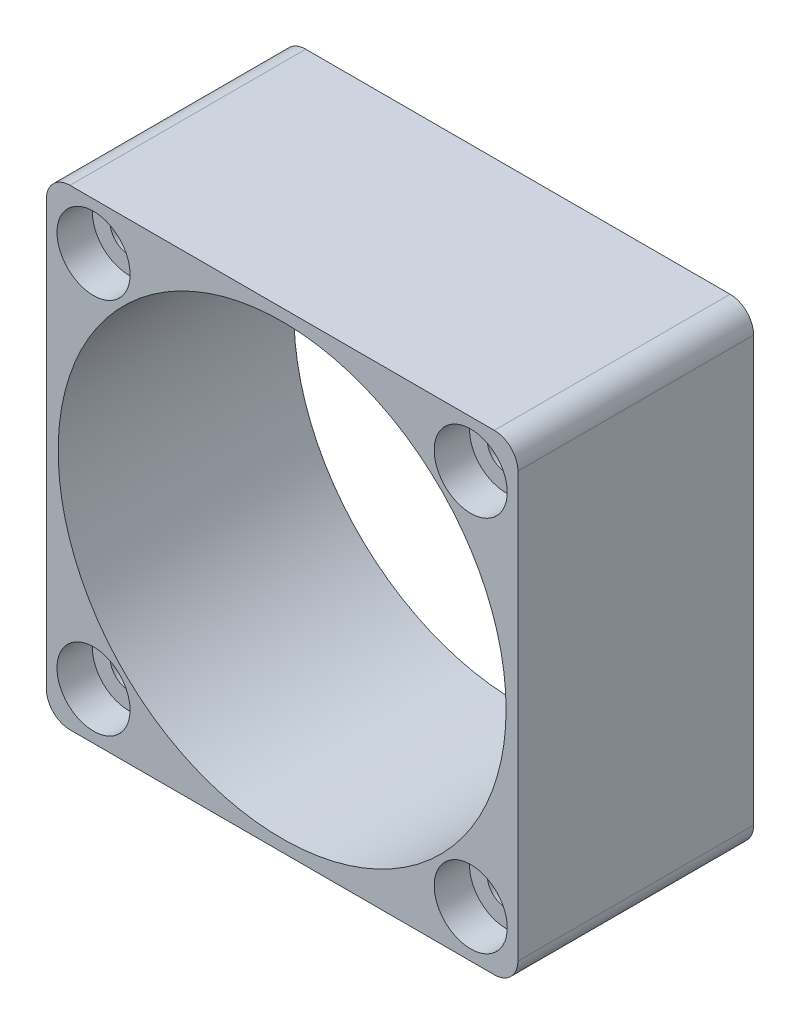
ISO-10303-21;
HEADER;
FILE_DESCRIPTION(('STEP AP214'),'2;1');
FILE_NAME('part.step','',(''),(''),'','','');
FILE_SCHEMA(('AUTOMOTIVE_DESIGN { 1 0 10303 214 1 1 1 1 }'));
ENDSEC;
DATA;
#1=APPLICATION_CONTEXT('core data for automotive mechanical design processes');
#2=APPLICATION_PROTOCOL_DEFINITION('international standard','automotive_design',2000,#1);
#3=PRODUCT_CONTEXT('',#1,'mechanical');
#4=PRODUCT('Part','Part','',(#3));
#5=PRODUCT_RELATED_PRODUCT_CATEGORY('part','',(#4));
#6=PRODUCT_DEFINITION_FORMATION('','',#4);
#7=PRODUCT_DEFINITION_CONTEXT('part definition',#1,'design');
#8=PRODUCT_DEFINITION('design','',#6,#7);
#9=PRODUCT_DEFINITION_SHAPE('','',#8);
#10=(LENGTH_UNIT() NAMED_UNIT(*) SI_UNIT(.MILLI.,.METRE.));
#11=(NAMED_UNIT(*) PLANE_ANGLE_UNIT() SI_UNIT($,.RADIAN.));
#12=(NAMED_UNIT(*) SI_UNIT($,.STERADIAN.) SOLID_ANGLE_UNIT());
#13=UNCERTAINTY_MEASURE_WITH_UNIT(LENGTH_MEASURE(1.E-05),#10,'distance_accuracy_value','');
#14=(GEOMETRIC_REPRESENTATION_CONTEXT(3) GLOBAL_UNCERTAINTY_ASSIGNED_CONTEXT((#13)) GLOBAL_UNIT_ASSIGNED_CONTEXT((#10,
#11,#12)) REPRESENTATION_CONTEXT('',''));
#15=CARTESIAN_POINT('',(0.,0.,0.));
#16=DIRECTION('',(0.,0.,1.));
#17=DIRECTION('',(1.,0.,0.));
#18=AXIS2_PLACEMENT_3D('',#15,#16,#17);
#19=CARTESIAN_POINT('',(-16.,16.,0.));
#20=DIRECTION('',(0.,0.,1.));
#21=DIRECTION('',(1.,0.,0.));
#22=AXIS2_PLACEMENT_3D('',#19,#20,#21);
#23=CYLINDRICAL_SURFACE('',#22,1.6);
#24=CARTESIAN_POINT('',(-16.,16.,0.));
#25=DIRECTION('',(0.,0.,1.));
#26=DIRECTION('',(1.,0.,0.));
#27=AXIS2_PLACEMENT_3D('',#24,#25,#26);
#28=CIRCLE('',#27,1.6);
#29=CARTESIAN_POINT('',(-14.4,16.,0.));
#30=VERTEX_POINT('',#29);
#31=EDGE_CURVE('E200',#30,#30,#28,.T.);
#32=ORIENTED_EDGE('',*,*,#31,.F.);
#33=EDGE_LOOP('',(#32));
#34=FACE_BOUND('',#33,.T.);
#35=CARTESIAN_POINT('',(-16.,16.,17.));
#36=DIRECTION('',(0.,0.,1.));
#37=DIRECTION('',(1.,0.,0.));
#38=AXIS2_PLACEMENT_3D('',#35,#36,#37);
#39=CIRCLE('',#38,1.6);
#40=CARTESIAN_POINT('',(-14.4,16.,17.));
#41=VERTEX_POINT('',#40);
#42=EDGE_CURVE('E38',#41,#41,#39,.F.);
#43=ORIENTED_EDGE('',*,*,#42,.F.);
#44=EDGE_LOOP('',(#43));
#45=FACE_BOUND('',#44,.T.);
#46=ADVANCED_FACE('F34',(#34,#45),#23,.F.);
#47=CARTESIAN_POINT('',(16.,16.,0.));
#48=DIRECTION('',(0.,0.,1.));
#49=DIRECTION('',(1.,0.,0.));
#50=AXIS2_PLACEMENT_3D('',#47,#48,#49);
#51=CYLINDRICAL_SURFACE('',#50,1.6);
#52=CARTESIAN_POINT('',(16.,16.,0.));
#53=DIRECTION('',(0.,0.,1.));
#54=DIRECTION('',(1.,0.,0.));
#55=AXIS2_PLACEMENT_3D('',#52,#53,#54);
#56=CIRCLE('',#55,1.6);
#57=CARTESIAN_POINT('',(17.6,16.,0.));
#58=VERTEX_POINT('',#57);
#59=EDGE_CURVE('E197',#58,#58,#56,.T.);
#60=ORIENTED_EDGE('',*,*,#59,.F.);
#61=EDGE_LOOP('',(#60));
#62=FACE_BOUND('',#61,.T.);
#63=CARTESIAN_POINT('',(16.,16.,17.));
#64=DIRECTION('',(0.,0.,1.));
#65=DIRECTION('',(1.,0.,0.));
#66=AXIS2_PLACEMENT_3D('',#63,#64,#65);
#67=CIRCLE('',#66,1.6);
#68=CARTESIAN_POINT('',(17.6,16.,17.));
#69=VERTEX_POINT('',#68);
#70=EDGE_CURVE('E167',#69,#69,#67,.F.);
#71=ORIENTED_EDGE('',*,*,#70,.F.);
#72=EDGE_LOOP('',(#71));
#73=FACE_BOUND('',#72,.T.);
#74=ADVANCED_FACE('F237',(#62,#73),#51,.F.);
#75=CARTESIAN_POINT('',(16.,-16.,0.));
#76=DIRECTION('',(0.,0.,1.));
#77=DIRECTION('',(1.,0.,0.));
#78=AXIS2_PLACEMENT_3D('',#75,#76,#77);
#79=CYLINDRICAL_SURFACE('',#78,1.6);
#80=CARTESIAN_POINT('',(16.,-16.,0.));
#81=DIRECTION('',(0.,0.,1.));
#82=DIRECTION('',(1.,0.,0.));
#83=AXIS2_PLACEMENT_3D('',#80,#81,#82);
#84=CIRCLE('',#83,1.6);
#85=CARTESIAN_POINT('',(17.6,-16.,0.));
#86=VERTEX_POINT('',#85);
#87=EDGE_CURVE('E194',#86,#86,#84,.T.);
#88=ORIENTED_EDGE('',*,*,#87,.F.);
#89=EDGE_LOOP('',(#88));
#90=FACE_BOUND('',#89,.T.);
#91=CARTESIAN_POINT('',(16.,-16.,17.));
#92=DIRECTION('',(0.,0.,1.));
#93=DIRECTION('',(1.,0.,0.));
#94=AXIS2_PLACEMENT_3D('',#91,#92,#93);
#95=CIRCLE('',#94,1.6);
#96=CARTESIAN_POINT('',(17.6,-16.,17.));
#97=VERTEX_POINT('',#96);
#98=EDGE_CURVE('E163',#97,#97,#95,.F.);
#99=ORIENTED_EDGE('',*,*,#98,.F.);
#100=EDGE_LOOP('',(#99));
#101=FACE_BOUND('',#100,.T.);
#102=ADVANCED_FACE('F243',(#90,#101),#79,.F.);
#103=CARTESIAN_POINT('',(-16.,-16.,0.));
#104=DIRECTION('',(0.,0.,1.));
#105=DIRECTION('',(1.,0.,0.));
#106=AXIS2_PLACEMENT_3D('',#103,#104,#105);
#107=CYLINDRICAL_SURFACE('',#106,1.6);
#108=CARTESIAN_POINT('',(-16.,-16.,0.));
#109=DIRECTION('',(0.,0.,1.));
#110=DIRECTION('',(1.,0.,0.));
#111=AXIS2_PLACEMENT_3D('',#108,#109,#110);
#112=CIRCLE('',#111,1.6);
#113=CARTESIAN_POINT('',(-14.4,-16.,0.));
#114=VERTEX_POINT('',#113);
#115=EDGE_CURVE('E161',#114,#114,#112,.T.);
#116=ORIENTED_EDGE('',*,*,#115,.F.);
#117=EDGE_LOOP('',(#116));
#118=FACE_BOUND('',#117,.T.);
#119=CARTESIAN_POINT('',(-16.,-16.,17.));
#120=DIRECTION('',(0.,0.,1.));
#121=DIRECTION('',(1.,0.,0.));
#122=AXIS2_PLACEMENT_3D('',#119,#120,#121);
#123=CIRCLE('',#122,1.6);
#124=CARTESIAN_POINT('',(-14.4,-16.,17.));
#125=VERTEX_POINT('',#124);
#126=EDGE_CURVE('E158',#125,#125,#123,.F.);
#127=ORIENTED_EDGE('',*,*,#126,.F.);
#128=EDGE_LOOP('',(#127));
#129=FACE_BOUND('',#128,.T.);
#130=ADVANCED_FACE('F276',(#118,#129),#107,.F.);
#131=CARTESIAN_POINT('',(20.,20.,20.));
#132=DIRECTION('',(-1.,0.,0.));
#133=DIRECTION('',(0.,0.,1.));
#134=AXIS2_PLACEMENT_3D('',#131,#132,#133);
#135=PLANE('',#134);
#136=DIRECTION('',(0.,1.,0.));
#137=VECTOR('',#136,1.);
#138=CARTESIAN_POINT('',(20.,20.,20.));
#139=LINE('',#138,#137);
#140=CARTESIAN_POINT('',(20.,-18.,20.));
#141=VERTEX_POINT('',#140);
#142=CARTESIAN_POINT('',(20.,18.,20.));
#143=VERTEX_POINT('',#142);
#144=EDGE_CURVE('E130',#141,#143,#139,.T.);
#145=ORIENTED_EDGE('',*,*,#144,.F.);
#146=DIRECTION('',(0.,0.,-1.));
#147=VECTOR('',#146,1.);
#148=CARTESIAN_POINT('',(20.,-18.,20.));
#149=LINE('',#148,#147);
#150=CARTESIAN_POINT('',(20.,-18.,0.));
#151=VERTEX_POINT('',#150);
#152=EDGE_CURVE('E11',#141,#151,#149,.T.);
#153=ORIENTED_EDGE('',*,*,#152,.T.);
#154=DIRECTION('',(0.,1.,0.));
#155=VECTOR('',#154,1.);
#156=CARTESIAN_POINT('',(20.,20.,0.));
#157=LINE('',#156,#155);
#158=CARTESIAN_POINT('',(20.,18.,0.));
#159=VERTEX_POINT('',#158);
#160=EDGE_CURVE('E207',#151,#159,#157,.T.);
#161=ORIENTED_EDGE('',*,*,#160,.T.);
#162=DIRECTION('',(0.,0.,-1.));
#163=VECTOR('',#162,1.);
#164=CARTESIAN_POINT('',(20.,18.,20.));
#165=LINE('',#164,#163);
#166=EDGE_CURVE('E43',#159,#143,#165,.F.);
#167=ORIENTED_EDGE('',*,*,#166,.T.);
#168=EDGE_LOOP('',(#145,#153,#161,#167));
#169=FACE_BOUND('',#168,.T.);
#170=ADVANCED_FACE('F234',(#169),#135,.F.);
#171=CARTESIAN_POINT('',(-20.,20.,20.));
#172=DIRECTION('',(0.,-1.,0.));
#173=DIRECTION('',(0.,0.,-1.));
#174=AXIS2_PLACEMENT_3D('',#171,#172,#173);
#175=PLANE('',#174);
#176=DIRECTION('',(-1.,0.,0.));
#177=VECTOR('',#176,1.);
#178=CARTESIAN_POINT('',(-20.,20.,0.));
#179=LINE('',#178,#177);
#180=CARTESIAN_POINT('',(18.,20.,0.));
#181=VERTEX_POINT('',#180);
#182=CARTESIAN_POINT('',(-18.,20.,0.));
#183=VERTEX_POINT('',#182);
#184=EDGE_CURVE('E135',#181,#183,#179,.T.);
#185=ORIENTED_EDGE('',*,*,#184,.T.);
#186=DIRECTION('',(0.,0.,-1.));
#187=VECTOR('',#186,1.);
#188=CARTESIAN_POINT('',(-18.,20.,20.));
#189=LINE('',#188,#187);
#190=CARTESIAN_POINT('',(-18.,20.,20.));
#191=VERTEX_POINT('',#190);
#192=EDGE_CURVE('E51',#183,#191,#189,.F.);
#193=ORIENTED_EDGE('',*,*,#192,.T.);
#194=DIRECTION('',(-1.,0.,0.));
#195=VECTOR('',#194,1.);
#196=CARTESIAN_POINT('',(-20.,20.,20.));
#197=LINE('',#196,#195);
#198=CARTESIAN_POINT('',(18.,20.,20.));
#199=VERTEX_POINT('',#198);
#200=EDGE_CURVE('E133',#199,#191,#197,.T.);
#201=ORIENTED_EDGE('',*,*,#200,.F.);
#202=DIRECTION('',(0.,0.,-1.));
#203=VECTOR('',#202,1.);
#204=CARTESIAN_POINT('',(18.,20.,20.));
#205=LINE('',#204,#203);
#206=EDGE_CURVE('E153',#199,#181,#205,.T.);
#207=ORIENTED_EDGE('',*,*,#206,.T.);
#208=EDGE_LOOP('',(#185,#193,#201,#207));
#209=FACE_BOUND('',#208,.T.);
#210=ADVANCED_FACE('F217',(#209),#175,.F.);
#211=CARTESIAN_POINT('',(-20.,20.,20.));
#212=DIRECTION('',(1.,0.,0.));
#213=DIRECTION('',(0.,1.,0.));
#214=AXIS2_PLACEMENT_3D('',#211,#212,#213);
#215=PLANE('',#214);
#216=DIRECTION('',(0.,-1.,0.));
#217=VECTOR('',#216,1.);
#218=CARTESIAN_POINT('',(-20.,20.,0.));
#219=LINE('',#218,#217);
#220=CARTESIAN_POINT('',(-20.,18.,0.));
#221=VERTEX_POINT('',#220);
#222=CARTESIAN_POINT('',(-20.,-18.,0.));
#223=VERTEX_POINT('',#222);
#224=EDGE_CURVE('E131',#221,#223,#219,.T.);
#225=ORIENTED_EDGE('',*,*,#224,.T.);
#226=DIRECTION('',(0.,0.,-1.));
#227=VECTOR('',#226,1.);
#228=CARTESIAN_POINT('',(-20.,-18.,20.));
#229=LINE('',#228,#227);
#230=CARTESIAN_POINT('',(-20.,-18.,20.));
#231=VERTEX_POINT('',#230);
#232=EDGE_CURVE('E108',#223,#231,#229,.F.);
#233=ORIENTED_EDGE('',*,*,#232,.T.);
#234=DIRECTION('',(0.,-1.,0.));
#235=VECTOR('',#234,1.);
#236=CARTESIAN_POINT('',(-20.,20.,20.));
#237=LINE('',#236,#235);
#238=CARTESIAN_POINT('',(-20.,18.,20.));
#239=VERTEX_POINT('',#238);
#240=EDGE_CURVE('E211',#239,#231,#237,.T.);
#241=ORIENTED_EDGE('',*,*,#240,.F.);
#242=DIRECTION('',(0.,0.,-1.));
#243=VECTOR('',#242,1.);
#244=CARTESIAN_POINT('',(-20.,18.,20.));
#245=LINE('',#244,#243);
#246=EDGE_CURVE('E113',#239,#221,#245,.T.);
#247=ORIENTED_EDGE('',*,*,#246,.T.);
#248=EDGE_LOOP('',(#225,#233,#241,#247));
#249=FACE_BOUND('',#248,.T.);
#250=ADVANCED_FACE('F226',(#249),#215,.F.);
#251=CARTESIAN_POINT('',(-20.,-20.,20.));
#252=DIRECTION('',(0.,1.,0.));
#253=DIRECTION('',(0.,0.,1.));
#254=AXIS2_PLACEMENT_3D('',#251,#252,#253);
#255=PLANE('',#254);
#256=DIRECTION('',(1.,0.,0.));
#257=VECTOR('',#256,1.);
#258=CARTESIAN_POINT('',(-20.,-20.,20.));
#259=LINE('',#258,#257);
#260=CARTESIAN_POINT('',(-18.,-20.,20.));
#261=VERTEX_POINT('',#260);
#262=CARTESIAN_POINT('',(18.,-20.,20.));
#263=VERTEX_POINT('',#262);
#264=EDGE_CURVE('E123',#261,#263,#259,.T.);
#265=ORIENTED_EDGE('',*,*,#264,.F.);
#266=DIRECTION('',(0.,0.,-1.));
#267=VECTOR('',#266,1.);
#268=CARTESIAN_POINT('',(-18.,-20.,20.));
#269=LINE('',#268,#267);
#270=CARTESIAN_POINT('',(-18.,-20.,0.));
#271=VERTEX_POINT('',#270);
#272=EDGE_CURVE('E107',#261,#271,#269,.T.);
#273=ORIENTED_EDGE('',*,*,#272,.T.);
#274=DIRECTION('',(1.,0.,0.));
#275=VECTOR('',#274,1.);
#276=CARTESIAN_POINT('',(-20.,-20.,0.));
#277=LINE('',#276,#275);
#278=CARTESIAN_POINT('',(18.,-20.,0.));
#279=VERTEX_POINT('',#278);
#280=EDGE_CURVE('E120',#271,#279,#277,.T.);
#281=ORIENTED_EDGE('',*,*,#280,.T.);
#282=DIRECTION('',(0.,0.,-1.));
#283=VECTOR('',#282,1.);
#284=CARTESIAN_POINT('',(18.,-20.,20.));
#285=LINE('',#284,#283);
#286=EDGE_CURVE('E125',#279,#263,#285,.F.);
#287=ORIENTED_EDGE('',*,*,#286,.T.);
#288=EDGE_LOOP('',(#265,#273,#281,#287));
#289=FACE_BOUND('',#288,.T.);
#290=ADVANCED_FACE('F119',(#289),#255,.F.);
#291=CARTESIAN_POINT('',(0.,0.,20.));
#292=DIRECTION('',(0.,0.,1.));
#293=DIRECTION('',(1.,0.,0.));
#294=AXIS2_PLACEMENT_3D('',#291,#292,#293);
#295=PLANE('',#294);
#296=CARTESIAN_POINT('',(-16.,16.,20.));
#297=DIRECTION('',(0.,0.,1.));
#298=DIRECTION('',(1.,0.,0.));
#299=AXIS2_PLACEMENT_3D('',#296,#297,#298);
#300=CIRCLE('',#299,3.1);
#301=CARTESIAN_POINT('',(-12.9,16.,20.));
#302=VERTEX_POINT('',#301);
#303=EDGE_CURVE('E183',#302,#302,#300,.T.);
#304=ORIENTED_EDGE('',*,*,#303,.F.);
#305=EDGE_LOOP('',(#304));
#306=FACE_BOUND('',#305,.T.);
#307=CARTESIAN_POINT('',(16.,16.,20.));
#308=DIRECTION('',(0.,0.,1.));
#309=DIRECTION('',(1.,0.,0.));
#310=AXIS2_PLACEMENT_3D('',#307,#308,#309);
#311=CIRCLE('',#310,3.1);
#312=CARTESIAN_POINT('',(19.1,16.,20.));
#313=VERTEX_POINT('',#312);
#314=EDGE_CURVE('E176',#313,#313,#311,.T.);
#315=ORIENTED_EDGE('',*,*,#314,.F.);
#316=EDGE_LOOP('',(#315));
#317=FACE_BOUND('',#316,.T.);
#318=CARTESIAN_POINT('',(16.,-16.,20.));
#319=DIRECTION('',(0.,0.,1.));
#320=DIRECTION('',(1.,0.,0.));
#321=AXIS2_PLACEMENT_3D('',#318,#319,#320);
#322=CIRCLE('',#321,3.1);
#323=CARTESIAN_POINT('',(19.1,-16.,20.));
#324=VERTEX_POINT('',#323);
#325=EDGE_CURVE('E169',#324,#324,#322,.T.);
#326=ORIENTED_EDGE('',*,*,#325,.F.);
#327=EDGE_LOOP('',(#326));
#328=FACE_BOUND('',#327,.T.);
#329=CARTESIAN_POINT('',(-16.,-16.,20.));
#330=DIRECTION('',(0.,0.,1.));
#331=DIRECTION('',(1.,0.,0.));
#332=AXIS2_PLACEMENT_3D('',#329,#330,#331);
#333=CIRCLE('',#332,3.1);
#334=CARTESIAN_POINT('',(-12.9,-16.,20.));
#335=VERTEX_POINT('',#334);
#336=EDGE_CURVE('E165',#335,#335,#333,.T.);
#337=ORIENTED_EDGE('',*,*,#336,.F.);
#338=EDGE_LOOP('',(#337));
#339=FACE_BOUND('',#338,.T.);
#340=CARTESIAN_POINT('',(0.,0.,20.));
#341=DIRECTION('',(0.,0.,1.));
#342=DIRECTION('',(1.,0.,0.));
#343=AXIS2_PLACEMENT_3D('',#340,#341,#342);
#344=CIRCLE('',#343,19.);
#345=CARTESIAN_POINT('',(19.,0.,20.));
#346=VERTEX_POINT('',#345);
#347=EDGE_CURVE('E203',#346,#346,#344,.T.);
#348=ORIENTED_EDGE('',*,*,#347,.F.);
#349=EDGE_LOOP('',(#348));
#350=FACE_BOUND('',#349,.T.);
#351=ORIENTED_EDGE('',*,*,#240,.T.);
#352=CARTESIAN_POINT('',(-18.,-18.,20.));
#353=DIRECTION('',(0.,0.,1.));
#354=DIRECTION('',(1.,0.,0.));
#355=AXIS2_PLACEMENT_3D('',#352,#353,#354);
#356=CIRCLE('',#355,2.);
#357=EDGE_CURVE('E151',#231,#261,#356,.T.);
#358=ORIENTED_EDGE('',*,*,#357,.T.);
#359=ORIENTED_EDGE('',*,*,#264,.T.);
#360=CARTESIAN_POINT('',(18.,-18.,20.));
#361=DIRECTION('',(0.,0.,1.));
#362=DIRECTION('',(1.,0.,0.));
#363=AXIS2_PLACEMENT_3D('',#360,#361,#362);
#364=CIRCLE('',#363,2.);
#365=EDGE_CURVE('E147',#263,#141,#364,.T.);
#366=ORIENTED_EDGE('',*,*,#365,.T.);
#367=ORIENTED_EDGE('',*,*,#144,.T.);
#368=CARTESIAN_POINT('',(18.,18.,20.));
#369=DIRECTION('',(0.,0.,1.));
#370=DIRECTION('',(1.,0.,0.));
#371=AXIS2_PLACEMENT_3D('',#368,#369,#370);
#372=CIRCLE('',#371,2.);
#373=EDGE_CURVE('E58',#143,#199,#372,.T.);
#374=ORIENTED_EDGE('',*,*,#373,.T.);
#375=ORIENTED_EDGE('',*,*,#200,.T.);
#376=CARTESIAN_POINT('',(-18.,18.,20.));
#377=DIRECTION('',(0.,0.,1.));
#378=DIRECTION('',(1.,0.,0.));
#379=AXIS2_PLACEMENT_3D('',#376,#377,#378);
#380=CIRCLE('',#379,2.);
#381=EDGE_CURVE('E149',#191,#239,#380,.T.);
#382=ORIENTED_EDGE('',*,*,#381,.T.);
#383=EDGE_LOOP('',(#351,#358,#359,#366,#367,#374,#375,#382));
#384=FACE_BOUND('',#383,.T.);
#385=ADVANCED_FACE('F224',(#306,#317,#328,#339,#350,#384),#295,.T.);
#386=CARTESIAN_POINT('',(0.,0.,0.));
#387=DIRECTION('',(0.,0.,1.));
#388=DIRECTION('',(1.,0.,0.));
#389=AXIS2_PLACEMENT_3D('',#386,#387,#388);
#390=PLANE('',#389);
#391=ORIENTED_EDGE('',*,*,#115,.T.);
#392=EDGE_LOOP('',(#391));
#393=FACE_BOUND('',#392,.T.);
#394=ORIENTED_EDGE('',*,*,#87,.T.);
#395=EDGE_LOOP('',(#394));
#396=FACE_BOUND('',#395,.T.);
#397=ORIENTED_EDGE('',*,*,#59,.T.);
#398=EDGE_LOOP('',(#397));
#399=FACE_BOUND('',#398,.T.);
#400=ORIENTED_EDGE('',*,*,#31,.T.);
#401=EDGE_LOOP('',(#400));
#402=FACE_BOUND('',#401,.T.);
#403=CARTESIAN_POINT('',(0.,0.,0.));
#404=DIRECTION('',(0.,0.,1.));
#405=DIRECTION('',(1.,0.,0.));
#406=AXIS2_PLACEMENT_3D('',#403,#404,#405);
#407=CIRCLE('',#406,19.);
#408=CARTESIAN_POINT('',(19.,0.,0.));
#409=VERTEX_POINT('',#408);
#410=EDGE_CURVE('E204',#409,#409,#407,.T.);
#411=ORIENTED_EDGE('',*,*,#410,.T.);
#412=EDGE_LOOP('',(#411));
#413=FACE_BOUND('',#412,.T.);
#414=ORIENTED_EDGE('',*,*,#280,.F.);
#415=CARTESIAN_POINT('',(-18.,-18.,0.));
#416=DIRECTION('',(0.,0.,1.));
#417=DIRECTION('',(1.,0.,0.));
#418=AXIS2_PLACEMENT_3D('',#415,#416,#417);
#419=CIRCLE('',#418,2.);
#420=EDGE_CURVE('E103',#271,#223,#419,.F.);
#421=ORIENTED_EDGE('',*,*,#420,.T.);
#422=ORIENTED_EDGE('',*,*,#224,.F.);
#423=CARTESIAN_POINT('',(-18.,18.,0.));
#424=DIRECTION('',(0.,0.,1.));
#425=DIRECTION('',(1.,0.,0.));
#426=AXIS2_PLACEMENT_3D('',#423,#424,#425);
#427=CIRCLE('',#426,2.);
#428=EDGE_CURVE('E114',#221,#183,#427,.F.);
#429=ORIENTED_EDGE('',*,*,#428,.T.);
#430=ORIENTED_EDGE('',*,*,#184,.F.);
#431=CARTESIAN_POINT('',(18.,18.,0.));
#432=DIRECTION('',(0.,0.,1.));
#433=DIRECTION('',(1.,0.,0.));
#434=AXIS2_PLACEMENT_3D('',#431,#432,#433);
#435=CIRCLE('',#434,2.);
#436=EDGE_CURVE('E124',#181,#159,#435,.F.);
#437=ORIENTED_EDGE('',*,*,#436,.T.);
#438=ORIENTED_EDGE('',*,*,#160,.F.);
#439=CARTESIAN_POINT('',(18.,-18.,0.));
#440=DIRECTION('',(0.,0.,1.));
#441=DIRECTION('',(1.,0.,0.));
#442=AXIS2_PLACEMENT_3D('',#439,#440,#441);
#443=CIRCLE('',#442,2.);
#444=EDGE_CURVE('E129',#151,#279,#443,.F.);
#445=ORIENTED_EDGE('',*,*,#444,.T.);
#446=EDGE_LOOP('',(#414,#421,#422,#429,#430,#437,#438,#445));
#447=FACE_BOUND('',#446,.T.);
#448=ADVANCED_FACE('F127',(#393,#396,#399,#402,#413,#447),#390,.F.);
#449=CARTESIAN_POINT('',(0.,0.,0.));
#450=DIRECTION('',(0.,0.,1.));
#451=DIRECTION('',(1.,0.,0.));
#452=AXIS2_PLACEMENT_3D('',#449,#450,#451);
#453=CYLINDRICAL_SURFACE('',#452,19.);
#454=ORIENTED_EDGE('',*,*,#410,.F.);
#455=EDGE_LOOP('',(#454));
#456=FACE_BOUND('',#455,.T.);
#457=ORIENTED_EDGE('',*,*,#347,.T.);
#458=EDGE_LOOP('',(#457));
#459=FACE_BOUND('',#458,.T.);
#460=ADVANCED_FACE('F250',(#456,#459),#453,.F.);
#461=CARTESIAN_POINT('',(-18.,-18.,20.));
#462=DIRECTION('',(0.,0.,-1.));
#463=DIRECTION('',(-1.,0.,0.));
#464=AXIS2_PLACEMENT_3D('',#461,#462,#463);
#465=CYLINDRICAL_SURFACE('',#464,2.);
#466=ORIENTED_EDGE('',*,*,#357,.F.);
#467=ORIENTED_EDGE('',*,*,#232,.F.);
#468=ORIENTED_EDGE('',*,*,#420,.F.);
#469=ORIENTED_EDGE('',*,*,#272,.F.);
#470=EDGE_LOOP('',(#466,#467,#468,#469));
#471=FACE_BOUND('',#470,.T.);
#472=ADVANCED_FACE('F106',(#471),#465,.T.);
#473=CARTESIAN_POINT('',(-18.,18.,20.));
#474=DIRECTION('',(0.,0.,-1.));
#475=DIRECTION('',(-1.,0.,0.));
#476=AXIS2_PLACEMENT_3D('',#473,#474,#475);
#477=CYLINDRICAL_SURFACE('',#476,2.);
#478=ORIENTED_EDGE('',*,*,#381,.F.);
#479=ORIENTED_EDGE('',*,*,#192,.F.);
#480=ORIENTED_EDGE('',*,*,#428,.F.);
#481=ORIENTED_EDGE('',*,*,#246,.F.);
#482=EDGE_LOOP('',(#478,#479,#480,#481));
#483=FACE_BOUND('',#482,.T.);
#484=ADVANCED_FACE('F221',(#483),#477,.T.);
#485=CARTESIAN_POINT('',(18.,-18.,20.));
#486=DIRECTION('',(0.,0.,-1.));
#487=DIRECTION('',(-1.,0.,0.));
#488=AXIS2_PLACEMENT_3D('',#485,#486,#487);
#489=CYLINDRICAL_SURFACE('',#488,2.);
#490=ORIENTED_EDGE('',*,*,#365,.F.);
#491=ORIENTED_EDGE('',*,*,#286,.F.);
#492=ORIENTED_EDGE('',*,*,#444,.F.);
#493=ORIENTED_EDGE('',*,*,#152,.F.);
#494=EDGE_LOOP('',(#490,#491,#492,#493));
#495=FACE_BOUND('',#494,.T.);
#496=ADVANCED_FACE('F319',(#495),#489,.T.);
#497=CARTESIAN_POINT('',(18.,18.,20.));
#498=DIRECTION('',(0.,0.,-1.));
#499=DIRECTION('',(-1.,0.,0.));
#500=AXIS2_PLACEMENT_3D('',#497,#498,#499);
#501=CYLINDRICAL_SURFACE('',#500,2.);
#502=ORIENTED_EDGE('',*,*,#373,.F.);
#503=ORIENTED_EDGE('',*,*,#166,.F.);
#504=ORIENTED_EDGE('',*,*,#436,.F.);
#505=ORIENTED_EDGE('',*,*,#206,.F.);
#506=EDGE_LOOP('',(#502,#503,#504,#505));
#507=FACE_BOUND('',#506,.T.);
#508=ADVANCED_FACE('F36',(#507),#501,.T.);
#509=CARTESIAN_POINT('',(-16.,-16.,17.));
#510=DIRECTION('',(0.,0.,1.));
#511=DIRECTION('',(1.,0.,0.));
#512=AXIS2_PLACEMENT_3D('',#509,#510,#511);
#513=PLANE('',#512);
#514=CARTESIAN_POINT('',(-16.,-16.,17.));
#515=DIRECTION('',(0.,0.,1.));
#516=DIRECTION('',(1.,0.,0.));
#517=AXIS2_PLACEMENT_3D('',#514,#515,#516);
#518=CIRCLE('',#517,3.1);
#519=CARTESIAN_POINT('',(-12.9,-16.,17.));
#520=VERTEX_POINT('',#519);
#521=EDGE_CURVE('E162',#520,#520,#518,.T.);
#522=ORIENTED_EDGE('',*,*,#521,.T.);
#523=EDGE_LOOP('',(#522));
#524=FACE_BOUND('',#523,.T.);
#525=ORIENTED_EDGE('',*,*,#126,.T.);
#526=EDGE_LOOP('',(#525));
#527=FACE_BOUND('',#526,.T.);
#528=ADVANCED_FACE('F292',(#524,#527),#513,.T.);
#529=CARTESIAN_POINT('',(-16.,-16.,17.));
#530=DIRECTION('',(0.,0.,1.));
#531=DIRECTION('',(1.,0.,0.));
#532=AXIS2_PLACEMENT_3D('',#529,#530,#531);
#533=CYLINDRICAL_SURFACE('',#532,3.1);
#534=ORIENTED_EDGE('',*,*,#521,.F.);
#535=EDGE_LOOP('',(#534));
#536=FACE_BOUND('',#535,.T.);
#537=ORIENTED_EDGE('',*,*,#336,.T.);
#538=EDGE_LOOP('',(#537));
#539=FACE_BOUND('',#538,.T.);
#540=ADVANCED_FACE('F282',(#536,#539),#533,.F.);
#541=CARTESIAN_POINT('',(16.,-16.,17.));
#542=DIRECTION('',(0.,0.,1.));
#543=DIRECTION('',(1.,0.,0.));
#544=AXIS2_PLACEMENT_3D('',#541,#542,#543);
#545=PLANE('',#544);
#546=CARTESIAN_POINT('',(16.,-16.,17.));
#547=DIRECTION('',(0.,0.,1.));
#548=DIRECTION('',(1.,0.,0.));
#549=AXIS2_PLACEMENT_3D('',#546,#547,#548);
#550=CIRCLE('',#549,3.1);
#551=CARTESIAN_POINT('',(19.1,-16.,17.));
#552=VERTEX_POINT('',#551);
#553=EDGE_CURVE('E166',#552,#552,#550,.T.);
#554=ORIENTED_EDGE('',*,*,#553,.T.);
#555=EDGE_LOOP('',(#554));
#556=FACE_BOUND('',#555,.T.);
#557=ORIENTED_EDGE('',*,*,#98,.T.);
#558=EDGE_LOOP('',(#557));
#559=FACE_BOUND('',#558,.T.);
#560=ADVANCED_FACE('F279',(#556,#559),#545,.T.);
#561=CARTESIAN_POINT('',(16.,-16.,17.));
#562=DIRECTION('',(0.,0.,1.));
#563=DIRECTION('',(1.,0.,0.));
#564=AXIS2_PLACEMENT_3D('',#561,#562,#563);
#565=CYLINDRICAL_SURFACE('',#564,3.1);
#566=ORIENTED_EDGE('',*,*,#553,.F.);
#567=EDGE_LOOP('',(#566));
#568=FACE_BOUND('',#567,.T.);
#569=ORIENTED_EDGE('',*,*,#325,.T.);
#570=EDGE_LOOP('',(#569));
#571=FACE_BOUND('',#570,.T.);
#572=ADVANCED_FACE('F281',(#568,#571),#565,.F.);
#573=CARTESIAN_POINT('',(16.,16.,17.));
#574=DIRECTION('',(0.,0.,1.));
#575=DIRECTION('',(1.,0.,0.));
#576=AXIS2_PLACEMENT_3D('',#573,#574,#575);
#577=PLANE('',#576);
#578=CARTESIAN_POINT('',(16.,16.,17.));
#579=DIRECTION('',(0.,0.,1.));
#580=DIRECTION('',(1.,0.,0.));
#581=AXIS2_PLACEMENT_3D('',#578,#579,#580);
#582=CIRCLE('',#581,3.1);
#583=CARTESIAN_POINT('',(19.1,16.,17.));
#584=VERTEX_POINT('',#583);
#585=EDGE_CURVE('E170',#584,#584,#582,.T.);
#586=ORIENTED_EDGE('',*,*,#585,.T.);
#587=EDGE_LOOP('',(#586));
#588=FACE_BOUND('',#587,.T.);
#589=ORIENTED_EDGE('',*,*,#70,.T.);
#590=EDGE_LOOP('',(#589));
#591=FACE_BOUND('',#590,.T.);
#592=ADVANCED_FACE('F289',(#588,#591),#577,.T.);
#593=CARTESIAN_POINT('',(16.,16.,17.));
#594=DIRECTION('',(0.,0.,1.));
#595=DIRECTION('',(1.,0.,0.));
#596=AXIS2_PLACEMENT_3D('',#593,#594,#595);
#597=CYLINDRICAL_SURFACE('',#596,3.1);
#598=ORIENTED_EDGE('',*,*,#585,.F.);
#599=EDGE_LOOP('',(#598));
#600=FACE_BOUND('',#599,.T.);
#601=ORIENTED_EDGE('',*,*,#314,.T.);
#602=EDGE_LOOP('',(#601));
#603=FACE_BOUND('',#602,.T.);
#604=ADVANCED_FACE('F296',(#600,#603),#597,.F.);
#605=CARTESIAN_POINT('',(-16.,16.,17.));
#606=DIRECTION('',(0.,0.,1.));
#607=DIRECTION('',(1.,0.,0.));
#608=AXIS2_PLACEMENT_3D('',#605,#606,#607);
#609=PLANE('',#608);
#610=CARTESIAN_POINT('',(-16.,16.,17.));
#611=DIRECTION('',(0.,0.,1.));
#612=DIRECTION('',(1.,0.,0.));
#613=AXIS2_PLACEMENT_3D('',#610,#611,#612);
#614=CIRCLE('',#613,3.1);
#615=CARTESIAN_POINT('',(-12.9,16.,17.));
#616=VERTEX_POINT('',#615);
#617=EDGE_CURVE('E392',#616,#616,#614,.T.);
#618=ORIENTED_EDGE('',*,*,#617,.T.);
#619=EDGE_LOOP('',(#618));
#620=FACE_BOUND('',#619,.T.);
#621=ORIENTED_EDGE('',*,*,#42,.T.);
#622=EDGE_LOOP('',(#621));
#623=FACE_BOUND('',#622,.T.);
#624=ADVANCED_FACE('F366',(#620,#623),#609,.T.);
#625=CARTESIAN_POINT('',(-16.,16.,17.));
#626=DIRECTION('',(0.,0.,1.));
#627=DIRECTION('',(1.,0.,0.));
#628=AXIS2_PLACEMENT_3D('',#625,#626,#627);
#629=CYLINDRICAL_SURFACE('',#628,3.1);
#630=ORIENTED_EDGE('',*,*,#617,.F.);
#631=EDGE_LOOP('',(#630));
#632=FACE_BOUND('',#631,.T.);
#633=ORIENTED_EDGE('',*,*,#303,.T.);
#634=EDGE_LOOP('',(#633));
#635=FACE_BOUND('',#634,.T.);
#636=ADVANCED_FACE('F375',(#632,#635),#629,.F.);
#637=CLOSED_SHELL('',(#46,#74,#102,#130,#170,#210,#250,#290,#385,#448,#460,#472,#484,#496,#508,
#528,#540,#560,#572,#592,#604,#624,#636));
#638=MANIFOLD_SOLID_BREP('B2',#637);
#639=ADVANCED_BREP_SHAPE_REPRESENTATION('',(#18,#638),#14);
#640=SHAPE_DEFINITION_REPRESENTATION(#9,#639);
ENDSEC;
END-ISO-10303-21;
